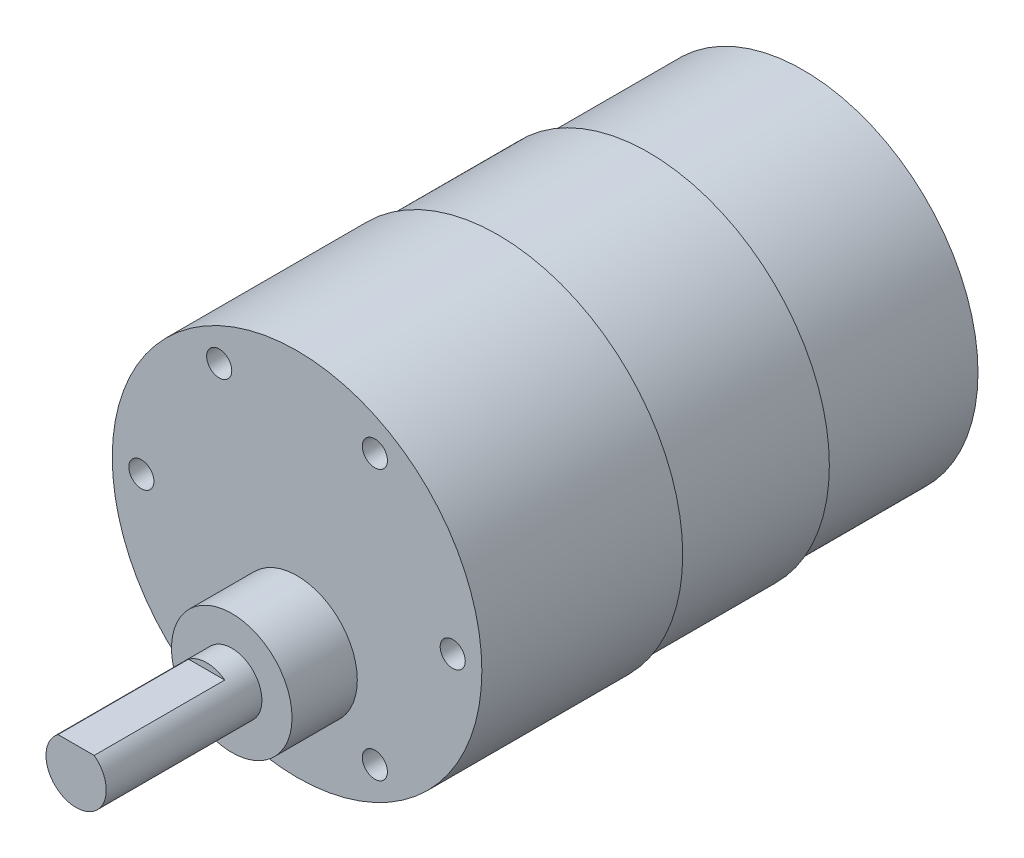
ISO-10303-21;
HEADER;
FILE_DESCRIPTION(('STEP AP214'),'2;1');
FILE_NAME('part.step','',(''),(''),'','','');
FILE_SCHEMA(('AUTOMOTIVE_DESIGN { 1 0 10303 214 1 1 1 1 }'));
ENDSEC;
DATA;
#1=APPLICATION_CONTEXT('core data for automotive mechanical design processes');
#2=APPLICATION_PROTOCOL_DEFINITION('international standard','automotive_design',2000,#1);
#3=PRODUCT_CONTEXT('',#1,'mechanical');
#4=PRODUCT('Part','Part','',(#3));
#5=PRODUCT_RELATED_PRODUCT_CATEGORY('part','',(#4));
#6=PRODUCT_DEFINITION_FORMATION('','',#4);
#7=PRODUCT_DEFINITION_CONTEXT('part definition',#1,'design');
#8=PRODUCT_DEFINITION('design','',#6,#7);
#9=PRODUCT_DEFINITION_SHAPE('','',#8);
#10=(LENGTH_UNIT() NAMED_UNIT(*) SI_UNIT(.MILLI.,.METRE.));
#11=(NAMED_UNIT(*) PLANE_ANGLE_UNIT() SI_UNIT($,.RADIAN.));
#12=(NAMED_UNIT(*) SI_UNIT($,.STERADIAN.) SOLID_ANGLE_UNIT());
#13=UNCERTAINTY_MEASURE_WITH_UNIT(LENGTH_MEASURE(1.E-05),#10,'distance_accuracy_value','');
#14=(GEOMETRIC_REPRESENTATION_CONTEXT(3) GLOBAL_UNCERTAINTY_ASSIGNED_CONTEXT((#13)) GLOBAL_UNIT_ASSIGNED_CONTEXT((#10,
#11,#12)) REPRESENTATION_CONTEXT('',''));
#15=CARTESIAN_POINT('',(0.,0.,0.));
#16=DIRECTION('',(0.,0.,1.));
#17=DIRECTION('',(1.,0.,0.));
#18=AXIS2_PLACEMENT_3D('',#15,#16,#17);
#19=CARTESIAN_POINT('',(0.,0.,15.4));
#20=DIRECTION('',(0.,0.,-1.));
#21=DIRECTION('',(-1.,0.,0.));
#22=AXIS2_PLACEMENT_3D('',#19,#20,#21);
#23=CYLINDRICAL_SURFACE('',#22,17.4);
#24=CARTESIAN_POINT('',(0.,0.,15.4));
#25=DIRECTION('',(0.,0.,1.));
#26=DIRECTION('',(1.,0.,0.));
#27=AXIS2_PLACEMENT_3D('',#24,#25,#26);
#28=CIRCLE('',#27,17.4);
#29=CARTESIAN_POINT('',(17.4,0.,15.4));
#30=VERTEX_POINT('',#29);
#31=EDGE_CURVE('E11',#30,#30,#28,.T.);
#32=ORIENTED_EDGE('',*,*,#31,.F.);
#33=EDGE_LOOP('',(#32));
#34=FACE_BOUND('',#33,.T.);
#35=CARTESIAN_POINT('',(0.,0.,0.));
#36=DIRECTION('',(0.,0.,1.));
#37=DIRECTION('',(1.,0.,0.));
#38=AXIS2_PLACEMENT_3D('',#35,#36,#37);
#39=CIRCLE('',#38,17.4);
#40=CARTESIAN_POINT('',(17.4,0.,0.));
#41=VERTEX_POINT('',#40);
#42=EDGE_CURVE('E43',#41,#41,#39,.T.);
#43=ORIENTED_EDGE('',*,*,#42,.T.);
#44=EDGE_LOOP('',(#43));
#45=FACE_BOUND('',#44,.T.);
#46=ADVANCED_FACE('F40',(#34,#45),#23,.T.);
#47=CARTESIAN_POINT('',(0.,0.,0.));
#48=DIRECTION('',(0.,0.,1.));
#49=DIRECTION('',(1.,0.,0.));
#50=AXIS2_PLACEMENT_3D('',#47,#48,#49);
#51=PLANE('',#50);
#52=ORIENTED_EDGE('',*,*,#42,.F.);
#53=EDGE_LOOP('',(#52));
#54=FACE_BOUND('',#53,.T.);
#55=ADVANCED_FACE('F133',(#54),#51,.F.);
#56=CARTESIAN_POINT('',(0.,0.,30.4));
#57=DIRECTION('',(0.,0.,-1.));
#58=DIRECTION('',(-1.,0.,0.));
#59=AXIS2_PLACEMENT_3D('',#56,#57,#58);
#60=CYLINDRICAL_SURFACE('',#59,18.);
#61=CARTESIAN_POINT('',(0.,0.,30.4));
#62=DIRECTION('',(0.,0.,1.));
#63=DIRECTION('',(1.,0.,0.));
#64=AXIS2_PLACEMENT_3D('',#61,#62,#63);
#65=CIRCLE('',#64,18.);
#66=CARTESIAN_POINT('',(18.,0.,30.4));
#67=VERTEX_POINT('',#66);
#68=EDGE_CURVE('E110',#67,#67,#65,.T.);
#69=ORIENTED_EDGE('',*,*,#68,.F.);
#70=EDGE_LOOP('',(#69));
#71=FACE_BOUND('',#70,.T.);
#72=CARTESIAN_POINT('',(0.,0.,15.4));
#73=DIRECTION('',(0.,0.,1.));
#74=DIRECTION('',(1.,0.,0.));
#75=AXIS2_PLACEMENT_3D('',#72,#73,#74);
#76=CIRCLE('',#75,18.);
#77=CARTESIAN_POINT('',(18.,0.,15.4));
#78=VERTEX_POINT('',#77);
#79=EDGE_CURVE('E106',#78,#78,#76,.T.);
#80=ORIENTED_EDGE('',*,*,#79,.T.);
#81=EDGE_LOOP('',(#80));
#82=FACE_BOUND('',#81,.T.);
#83=ADVANCED_FACE('F119',(#71,#82),#60,.T.);
#84=CARTESIAN_POINT('',(0.,0.,15.4));
#85=DIRECTION('',(0.,0.,1.));
#86=DIRECTION('',(1.,0.,0.));
#87=AXIS2_PLACEMENT_3D('',#84,#85,#86);
#88=PLANE('',#87);
#89=ORIENTED_EDGE('',*,*,#31,.T.);
#90=EDGE_LOOP('',(#89));
#91=FACE_BOUND('',#90,.T.);
#92=ORIENTED_EDGE('',*,*,#79,.F.);
#93=EDGE_LOOP('',(#92));
#94=FACE_BOUND('',#93,.T.);
#95=ADVANCED_FACE('F121',(#91,#94),#88,.F.);
#96=CARTESIAN_POINT('',(0.,0.,50.4));
#97=DIRECTION('',(0.,0.,-1.));
#98=DIRECTION('',(-1.,0.,0.));
#99=AXIS2_PLACEMENT_3D('',#96,#97,#98);
#100=CYLINDRICAL_SURFACE('',#99,18.4);
#101=CARTESIAN_POINT('',(0.,0.,50.4));
#102=DIRECTION('',(0.,0.,1.));
#103=DIRECTION('',(1.,0.,0.));
#104=AXIS2_PLACEMENT_3D('',#101,#102,#103);
#105=CIRCLE('',#104,18.4);
#106=CARTESIAN_POINT('',(18.4,0.,50.4));
#107=VERTEX_POINT('',#106);
#108=EDGE_CURVE('E102',#107,#107,#105,.T.);
#109=ORIENTED_EDGE('',*,*,#108,.F.);
#110=EDGE_LOOP('',(#109));
#111=FACE_BOUND('',#110,.T.);
#112=CARTESIAN_POINT('',(0.,0.,30.4));
#113=DIRECTION('',(0.,0.,1.));
#114=DIRECTION('',(1.,0.,0.));
#115=AXIS2_PLACEMENT_3D('',#112,#113,#114);
#116=CIRCLE('',#115,18.4);
#117=CARTESIAN_POINT('',(18.4,0.,30.4));
#118=VERTEX_POINT('',#117);
#119=EDGE_CURVE('E100',#118,#118,#116,.T.);
#120=ORIENTED_EDGE('',*,*,#119,.T.);
#121=EDGE_LOOP('',(#120));
#122=FACE_BOUND('',#121,.T.);
#123=ADVANCED_FACE('F123',(#111,#122),#100,.T.);
#124=CARTESIAN_POINT('',(0.,0.,50.4));
#125=DIRECTION('',(0.,0.,1.));
#126=DIRECTION('',(1.,0.,0.));
#127=AXIS2_PLACEMENT_3D('',#124,#125,#126);
#128=PLANE('',#127);
#129=CARTESIAN_POINT('',(-15.5,0.,50.4));
#130=DIRECTION('',(0.,0.,1.));
#131=DIRECTION('',(1.,0.,0.));
#132=AXIS2_PLACEMENT_3D('',#129,#130,#131);
#133=CIRCLE('',#132,1.25);
#134=CARTESIAN_POINT('',(-14.25,0.,50.4));
#135=VERTEX_POINT('',#134);
#136=EDGE_CURVE('E194',#135,#135,#133,.T.);
#137=ORIENTED_EDGE('',*,*,#136,.F.);
#138=EDGE_LOOP('',(#137));
#139=FACE_BOUND('',#138,.T.);
#140=CARTESIAN_POINT('',(-7.74999999999997,13.4233937586588,50.4));
#141=DIRECTION('',(0.,0.,1.));
#142=DIRECTION('',(1.,0.,0.));
#143=AXIS2_PLACEMENT_3D('',#140,#141,#142);
#144=CIRCLE('',#143,1.25);
#145=CARTESIAN_POINT('',(-6.49999999999997,13.4233937586588,50.4));
#146=VERTEX_POINT('',#145);
#147=EDGE_CURVE('E186',#146,#146,#144,.T.);
#148=ORIENTED_EDGE('',*,*,#147,.F.);
#149=EDGE_LOOP('',(#148));
#150=FACE_BOUND('',#149,.T.);
#151=CARTESIAN_POINT('',(7.75000000000006,13.4233937586588,50.4));
#152=DIRECTION('',(0.,0.,1.));
#153=DIRECTION('',(1.,0.,0.));
#154=AXIS2_PLACEMENT_3D('',#151,#152,#153);
#155=CIRCLE('',#154,1.25);
#156=CARTESIAN_POINT('',(9.00000000000006,13.4233937586588,50.4));
#157=VERTEX_POINT('',#156);
#158=EDGE_CURVE('E147',#157,#157,#155,.T.);
#159=ORIENTED_EDGE('',*,*,#158,.F.);
#160=EDGE_LOOP('',(#159));
#161=FACE_BOUND('',#160,.T.);
#162=CARTESIAN_POINT('',(15.5,-1.08235921504137E-13,50.4));
#163=DIRECTION('',(0.,0.,1.));
#164=DIRECTION('',(1.,0.,0.));
#165=AXIS2_PLACEMENT_3D('',#162,#163,#164);
#166=CIRCLE('',#165,1.25);
#167=CARTESIAN_POINT('',(16.75,-1.08235921504137E-13,50.4));
#168=VERTEX_POINT('',#167);
#169=EDGE_CURVE('E155',#168,#168,#166,.T.);
#170=ORIENTED_EDGE('',*,*,#169,.F.);
#171=EDGE_LOOP('',(#170));
#172=FACE_BOUND('',#171,.T.);
#173=CARTESIAN_POINT('',(7.74999999999987,-13.4233937586589,50.4));
#174=DIRECTION('',(0.,0.,1.));
#175=DIRECTION('',(1.,0.,0.));
#176=AXIS2_PLACEMENT_3D('',#173,#174,#175);
#177=CIRCLE('',#176,1.25);
#178=CARTESIAN_POINT('',(8.99999999999987,-13.4233937586589,50.4));
#179=VERTEX_POINT('',#178);
#180=EDGE_CURVE('E174',#179,#179,#177,.T.);
#181=ORIENTED_EDGE('',*,*,#180,.F.);
#182=EDGE_LOOP('',(#181));
#183=FACE_BOUND('',#182,.T.);
#184=CARTESIAN_POINT('',(-7.75000000000016,-13.4233937586587,50.4));
#185=DIRECTION('',(0.,0.,1.));
#186=DIRECTION('',(1.,0.,0.));
#187=AXIS2_PLACEMENT_3D('',#184,#185,#186);
#188=CIRCLE('',#187,1.25);
#189=CARTESIAN_POINT('',(-6.50000000000016,-13.4233937586587,50.4));
#190=VERTEX_POINT('',#189);
#191=EDGE_CURVE('E167',#190,#190,#188,.T.);
#192=ORIENTED_EDGE('',*,*,#191,.F.);
#193=EDGE_LOOP('',(#192));
#194=FACE_BOUND('',#193,.T.);
#195=CARTESIAN_POINT('',(0.,-7.,50.4));
#196=DIRECTION('',(0.,0.,1.));
#197=DIRECTION('',(1.,0.,0.));
#198=AXIS2_PLACEMENT_3D('',#195,#196,#197);
#199=CIRCLE('',#198,6.);
#200=CARTESIAN_POINT('',(6.,-7.,50.4));
#201=VERTEX_POINT('',#200);
#202=EDGE_CURVE('E87',#201,#201,#199,.T.);
#203=ORIENTED_EDGE('',*,*,#202,.F.);
#204=EDGE_LOOP('',(#203));
#205=FACE_BOUND('',#204,.T.);
#206=ORIENTED_EDGE('',*,*,#108,.T.);
#207=EDGE_LOOP('',(#206));
#208=FACE_BOUND('',#207,.T.);
#209=ADVANCED_FACE('F130',(#139,#150,#161,#172,#183,#194,#205,#208),#128,.T.);
#210=CARTESIAN_POINT('',(0.,0.,30.4));
#211=DIRECTION('',(0.,0.,1.));
#212=DIRECTION('',(1.,0.,0.));
#213=AXIS2_PLACEMENT_3D('',#210,#211,#212);
#214=PLANE('',#213);
#215=ORIENTED_EDGE('',*,*,#68,.T.);
#216=EDGE_LOOP('',(#215));
#217=FACE_BOUND('',#216,.T.);
#218=ORIENTED_EDGE('',*,*,#119,.F.);
#219=EDGE_LOOP('',(#218));
#220=FACE_BOUND('',#219,.T.);
#221=ADVANCED_FACE('F203',(#217,#220),#214,.F.);
#222=CARTESIAN_POINT('',(0.,-7.,56.9));
#223=DIRECTION('',(0.,0.,-1.));
#224=DIRECTION('',(-1.,0.,0.));
#225=AXIS2_PLACEMENT_3D('',#222,#223,#224);
#226=CYLINDRICAL_SURFACE('',#225,6.);
#227=CARTESIAN_POINT('',(0.,-7.,56.9));
#228=DIRECTION('',(0.,0.,1.));
#229=DIRECTION('',(1.,0.,0.));
#230=AXIS2_PLACEMENT_3D('',#227,#228,#229);
#231=CIRCLE('',#230,6.);
#232=CARTESIAN_POINT('',(6.,-7.,56.9));
#233=VERTEX_POINT('',#232);
#234=EDGE_CURVE('E91',#233,#233,#231,.T.);
#235=ORIENTED_EDGE('',*,*,#234,.F.);
#236=EDGE_LOOP('',(#235));
#237=FACE_BOUND('',#236,.T.);
#238=ORIENTED_EDGE('',*,*,#202,.T.);
#239=EDGE_LOOP('',(#238));
#240=FACE_BOUND('',#239,.T.);
#241=ADVANCED_FACE('F222',(#237,#240),#226,.T.);
#242=CARTESIAN_POINT('',(0.,-7.,56.9));
#243=DIRECTION('',(0.,0.,1.));
#244=DIRECTION('',(1.,0.,0.));
#245=AXIS2_PLACEMENT_3D('',#242,#243,#244);
#246=PLANE('',#245);
#247=CARTESIAN_POINT('',(0.,-7.,56.9));
#248=DIRECTION('',(0.,0.,1.));
#249=DIRECTION('',(1.,0.,0.));
#250=AXIS2_PLACEMENT_3D('',#247,#248,#249);
#251=CIRCLE('',#250,3.);
#252=CARTESIAN_POINT('',(3.,-7.,56.9));
#253=VERTEX_POINT('',#252);
#254=EDGE_CURVE('E83',#253,#253,#251,.T.);
#255=ORIENTED_EDGE('',*,*,#254,.F.);
#256=EDGE_LOOP('',(#255));
#257=FACE_BOUND('',#256,.T.);
#258=ORIENTED_EDGE('',*,*,#234,.T.);
#259=EDGE_LOOP('',(#258));
#260=FACE_BOUND('',#259,.T.);
#261=ADVANCED_FACE('F228',(#257,#260),#246,.T.);
#262=CARTESIAN_POINT('',(0.,-7.,72.4));
#263=DIRECTION('',(0.,0.,-1.));
#264=DIRECTION('',(-1.,0.,0.));
#265=AXIS2_PLACEMENT_3D('',#262,#263,#264);
#266=CYLINDRICAL_SURFACE('',#265,3.);
#267=CARTESIAN_POINT('',(0.,-7.,72.4));
#268=DIRECTION('',(0.,0.,1.));
#269=DIRECTION('',(1.,0.,0.));
#270=AXIS2_PLACEMENT_3D('',#267,#268,#269);
#271=CIRCLE('',#270,3.);
#272=CARTESIAN_POINT('',(-1.8,-4.6,72.4));
#273=VERTEX_POINT('',#272);
#274=CARTESIAN_POINT('',(1.8,-4.6,72.4));
#275=VERTEX_POINT('',#274);
#276=EDGE_CURVE('E82',#273,#275,#271,.T.);
#277=ORIENTED_EDGE('',*,*,#276,.F.);
#278=DIRECTION('',(0.,0.,1.));
#279=VECTOR('',#278,1.);
#280=CARTESIAN_POINT('',(-1.8,-4.6,59.4));
#281=LINE('',#280,#279);
#282=CARTESIAN_POINT('',(-1.8,-4.6,59.4));
#283=VERTEX_POINT('',#282);
#284=EDGE_CURVE('E57',#283,#273,#281,.T.);
#285=ORIENTED_EDGE('',*,*,#284,.F.);
#286=CARTESIAN_POINT('',(0.,-7.00000000000001,59.4));
#287=DIRECTION('',(0.,0.,1.));
#288=DIRECTION('',(-1.,0.,0.));
#289=AXIS2_PLACEMENT_3D('',#286,#287,#288);
#290=CIRCLE('',#289,3.00000000000001);
#291=CARTESIAN_POINT('',(1.8,-4.6,59.4));
#292=VERTEX_POINT('',#291);
#293=EDGE_CURVE('E75',#292,#283,#290,.T.);
#294=ORIENTED_EDGE('',*,*,#293,.F.);
#295=DIRECTION('',(0.,0.,1.));
#296=VECTOR('',#295,1.);
#297=CARTESIAN_POINT('',(1.8,-4.6,59.4));
#298=LINE('',#297,#296);
#299=EDGE_CURVE('E64',#292,#275,#298,.T.);
#300=ORIENTED_EDGE('',*,*,#299,.T.);
#301=EDGE_LOOP('',(#277,#285,#294,#300));
#302=FACE_BOUND('',#301,.T.);
#303=ORIENTED_EDGE('',*,*,#254,.T.);
#304=EDGE_LOOP('',(#303));
#305=FACE_BOUND('',#304,.T.);
#306=ADVANCED_FACE('F80',(#302,#305),#266,.T.);
#307=CARTESIAN_POINT('',(0.,-7.,72.4));
#308=DIRECTION('',(0.,0.,1.));
#309=DIRECTION('',(1.,0.,0.));
#310=AXIS2_PLACEMENT_3D('',#307,#308,#309);
#311=PLANE('',#310);
#312=DIRECTION('',(1.,0.,0.));
#313=VECTOR('',#312,1.);
#314=CARTESIAN_POINT('',(-1.8,-4.6,72.4));
#315=LINE('',#314,#313);
#316=EDGE_CURVE('E69',#273,#275,#315,.T.);
#317=ORIENTED_EDGE('',*,*,#316,.F.);
#318=ORIENTED_EDGE('',*,*,#276,.T.);
#319=EDGE_LOOP('',(#317,#318));
#320=FACE_BOUND('',#319,.T.);
#321=ADVANCED_FACE('F85',(#320),#311,.T.);
#322=CARTESIAN_POINT('',(-1.8,-4.6,59.4));
#323=DIRECTION('',(0.,-1.,0.));
#324=DIRECTION('',(0.,0.,-1.));
#325=AXIS2_PLACEMENT_3D('',#322,#323,#324);
#326=PLANE('',#325);
#327=ORIENTED_EDGE('',*,*,#316,.T.);
#328=ORIENTED_EDGE('',*,*,#299,.F.);
#329=DIRECTION('',(1.,0.,0.));
#330=VECTOR('',#329,1.);
#331=CARTESIAN_POINT('',(-1.8,-4.6,59.4));
#332=LINE('',#331,#330);
#333=EDGE_CURVE('E157',#283,#292,#332,.T.);
#334=ORIENTED_EDGE('',*,*,#333,.F.);
#335=ORIENTED_EDGE('',*,*,#284,.T.);
#336=EDGE_LOOP('',(#327,#328,#334,#335));
#337=FACE_BOUND('',#336,.T.);
#338=ADVANCED_FACE('F70',(#337),#326,.F.);
#339=CARTESIAN_POINT('',(0.,-7.00000000000001,59.4));
#340=DIRECTION('',(0.,0.,-1.));
#341=DIRECTION('',(-1.,0.,0.));
#342=AXIS2_PLACEMENT_3D('',#339,#340,#341);
#343=PLANE('',#342);
#344=ORIENTED_EDGE('',*,*,#293,.T.);
#345=ORIENTED_EDGE('',*,*,#333,.T.);
#346=EDGE_LOOP('',(#344,#345));
#347=FACE_BOUND('',#346,.T.);
#348=ADVANCED_FACE('F241',(#347),#343,.F.);
#349=CARTESIAN_POINT('',(-7.75000000000016,-13.4233937586587,39.64));
#350=DIRECTION('',(0.,0.,-1.));
#351=DIRECTION('',(-1.,0.,0.));
#352=AXIS2_PLACEMENT_3D('',#349,#350,#351);
#353=PLANE('',#352);
#354=CARTESIAN_POINT('',(-7.75000000000016,-13.4233937586587,39.64));
#355=DIRECTION('',(0.,0.,1.));
#356=DIRECTION('',(1.,0.,0.));
#357=AXIS2_PLACEMENT_3D('',#354,#355,#356);
#358=CIRCLE('',#357,1.25);
#359=CARTESIAN_POINT('',(-6.50000000000016,-13.4233937586587,39.64));
#360=VERTEX_POINT('',#359);
#361=EDGE_CURVE('E76',#360,#360,#358,.T.);
#362=ORIENTED_EDGE('',*,*,#361,.T.);
#363=EDGE_LOOP('',(#362));
#364=FACE_BOUND('',#363,.T.);
#365=ADVANCED_FACE('F244',(#364),#353,.F.);
#366=CARTESIAN_POINT('',(-7.75000000000016,-13.4233937586587,50.4));
#367=DIRECTION('',(0.,0.,1.));
#368=DIRECTION('',(1.,0.,0.));
#369=AXIS2_PLACEMENT_3D('',#366,#367,#368);
#370=CYLINDRICAL_SURFACE('',#369,1.25);
#371=ORIENTED_EDGE('',*,*,#361,.F.);
#372=EDGE_LOOP('',(#371));
#373=FACE_BOUND('',#372,.T.);
#374=ORIENTED_EDGE('',*,*,#191,.T.);
#375=EDGE_LOOP('',(#374));
#376=FACE_BOUND('',#375,.T.);
#377=ADVANCED_FACE('F247',(#373,#376),#370,.F.);
#378=CARTESIAN_POINT('',(7.74999999999987,-13.4233937586589,39.64));
#379=DIRECTION('',(0.,0.,-1.));
#380=DIRECTION('',(-1.,0.,0.));
#381=AXIS2_PLACEMENT_3D('',#378,#379,#380);
#382=PLANE('',#381);
#383=CARTESIAN_POINT('',(7.74999999999987,-13.4233937586589,39.64));
#384=DIRECTION('',(0.,0.,1.));
#385=DIRECTION('',(1.,0.,0.));
#386=AXIS2_PLACEMENT_3D('',#383,#384,#385);
#387=CIRCLE('',#386,1.25);
#388=CARTESIAN_POINT('',(8.99999999999987,-13.4233937586589,39.64));
#389=VERTEX_POINT('',#388);
#390=EDGE_CURVE('E171',#389,#389,#387,.T.);
#391=ORIENTED_EDGE('',*,*,#390,.T.);
#392=EDGE_LOOP('',(#391));
#393=FACE_BOUND('',#392,.T.);
#394=ADVANCED_FACE('F251',(#393),#382,.F.);
#395=CARTESIAN_POINT('',(7.74999999999987,-13.4233937586589,50.4));
#396=DIRECTION('',(0.,0.,1.));
#397=DIRECTION('',(1.,0.,0.));
#398=AXIS2_PLACEMENT_3D('',#395,#396,#397);
#399=CYLINDRICAL_SURFACE('',#398,1.25);
#400=ORIENTED_EDGE('',*,*,#390,.F.);
#401=EDGE_LOOP('',(#400));
#402=FACE_BOUND('',#401,.T.);
#403=ORIENTED_EDGE('',*,*,#180,.T.);
#404=EDGE_LOOP('',(#403));
#405=FACE_BOUND('',#404,.T.);
#406=ADVANCED_FACE('F255',(#402,#405),#399,.F.);
#407=CARTESIAN_POINT('',(15.5,-1.08235921504137E-13,39.64));
#408=DIRECTION('',(0.,0.,-1.));
#409=DIRECTION('',(-1.,0.,0.));
#410=AXIS2_PLACEMENT_3D('',#407,#408,#409);
#411=PLANE('',#410);
#412=CARTESIAN_POINT('',(15.5,-1.08235921504137E-13,39.64));
#413=DIRECTION('',(0.,0.,1.));
#414=DIRECTION('',(1.,0.,0.));
#415=AXIS2_PLACEMENT_3D('',#412,#413,#414);
#416=CIRCLE('',#415,1.25);
#417=CARTESIAN_POINT('',(16.75,-1.08235921504137E-13,39.64));
#418=VERTEX_POINT('',#417);
#419=EDGE_CURVE('E178',#418,#418,#416,.T.);
#420=ORIENTED_EDGE('',*,*,#419,.T.);
#421=EDGE_LOOP('',(#420));
#422=FACE_BOUND('',#421,.T.);
#423=ADVANCED_FACE('F259',(#422),#411,.F.);
#424=CARTESIAN_POINT('',(15.5,-1.08235921504137E-13,50.4));
#425=DIRECTION('',(0.,0.,1.));
#426=DIRECTION('',(1.,0.,0.));
#427=AXIS2_PLACEMENT_3D('',#424,#425,#426);
#428=CYLINDRICAL_SURFACE('',#427,1.25);
#429=ORIENTED_EDGE('',*,*,#419,.F.);
#430=EDGE_LOOP('',(#429));
#431=FACE_BOUND('',#430,.T.);
#432=ORIENTED_EDGE('',*,*,#169,.T.);
#433=EDGE_LOOP('',(#432));
#434=FACE_BOUND('',#433,.T.);
#435=ADVANCED_FACE('F263',(#431,#434),#428,.F.);
#436=CARTESIAN_POINT('',(7.75000000000006,13.4233937586588,39.64));
#437=DIRECTION('',(0.,0.,-1.));
#438=DIRECTION('',(-1.,0.,0.));
#439=AXIS2_PLACEMENT_3D('',#436,#437,#438);
#440=PLANE('',#439);
#441=CARTESIAN_POINT('',(7.75000000000006,13.4233937586588,39.64));
#442=DIRECTION('',(0.,0.,1.));
#443=DIRECTION('',(1.,0.,0.));
#444=AXIS2_PLACEMENT_3D('',#441,#442,#443);
#445=CIRCLE('',#444,1.25);
#446=CARTESIAN_POINT('',(9.00000000000006,13.4233937586588,39.64));
#447=VERTEX_POINT('',#446);
#448=EDGE_CURVE('E150',#447,#447,#445,.T.);
#449=ORIENTED_EDGE('',*,*,#448,.T.);
#450=EDGE_LOOP('',(#449));
#451=FACE_BOUND('',#450,.T.);
#452=ADVANCED_FACE('F267',(#451),#440,.F.);
#453=CARTESIAN_POINT('',(7.75000000000006,13.4233937586588,50.4));
#454=DIRECTION('',(0.,0.,1.));
#455=DIRECTION('',(1.,0.,0.));
#456=AXIS2_PLACEMENT_3D('',#453,#454,#455);
#457=CYLINDRICAL_SURFACE('',#456,1.25);
#458=ORIENTED_EDGE('',*,*,#448,.F.);
#459=EDGE_LOOP('',(#458));
#460=FACE_BOUND('',#459,.T.);
#461=ORIENTED_EDGE('',*,*,#158,.T.);
#462=EDGE_LOOP('',(#461));
#463=FACE_BOUND('',#462,.T.);
#464=ADVANCED_FACE('F271',(#460,#463),#457,.F.);
#465=CARTESIAN_POINT('',(-7.74999999999997,13.4233937586588,39.64));
#466=DIRECTION('',(0.,0.,-1.));
#467=DIRECTION('',(-1.,0.,0.));
#468=AXIS2_PLACEMENT_3D('',#465,#466,#467);
#469=PLANE('',#468);
#470=CARTESIAN_POINT('',(-7.74999999999997,13.4233937586588,39.64));
#471=DIRECTION('',(0.,0.,1.));
#472=DIRECTION('',(1.,0.,0.));
#473=AXIS2_PLACEMENT_3D('',#470,#471,#472);
#474=CIRCLE('',#473,1.25);
#475=CARTESIAN_POINT('',(-6.49999999999997,13.4233937586588,39.64));
#476=VERTEX_POINT('',#475);
#477=EDGE_CURVE('E151',#476,#476,#474,.T.);
#478=ORIENTED_EDGE('',*,*,#477,.T.);
#479=EDGE_LOOP('',(#478));
#480=FACE_BOUND('',#479,.T.);
#481=ADVANCED_FACE('F275',(#480),#469,.F.);
#482=CARTESIAN_POINT('',(-7.74999999999997,13.4233937586588,50.4));
#483=DIRECTION('',(0.,0.,1.));
#484=DIRECTION('',(1.,0.,0.));
#485=AXIS2_PLACEMENT_3D('',#482,#483,#484);
#486=CYLINDRICAL_SURFACE('',#485,1.25);
#487=ORIENTED_EDGE('',*,*,#477,.F.);
#488=EDGE_LOOP('',(#487));
#489=FACE_BOUND('',#488,.T.);
#490=ORIENTED_EDGE('',*,*,#147,.T.);
#491=EDGE_LOOP('',(#490));
#492=FACE_BOUND('',#491,.T.);
#493=ADVANCED_FACE('F279',(#489,#492),#486,.F.);
#494=CARTESIAN_POINT('',(-15.5,0.,39.64));
#495=DIRECTION('',(0.,0.,-1.));
#496=DIRECTION('',(-1.,0.,0.));
#497=AXIS2_PLACEMENT_3D('',#494,#495,#496);
#498=PLANE('',#497);
#499=CARTESIAN_POINT('',(-15.5,0.,39.64));
#500=DIRECTION('',(0.,0.,1.));
#501=DIRECTION('',(1.,0.,0.));
#502=AXIS2_PLACEMENT_3D('',#499,#500,#501);
#503=CIRCLE('',#502,1.25);
#504=CARTESIAN_POINT('',(-14.25,0.,39.64));
#505=VERTEX_POINT('',#504);
#506=EDGE_CURVE('E190',#505,#505,#503,.T.);
#507=ORIENTED_EDGE('',*,*,#506,.T.);
#508=EDGE_LOOP('',(#507));
#509=FACE_BOUND('',#508,.T.);
#510=ADVANCED_FACE('F283',(#509),#498,.F.);
#511=CARTESIAN_POINT('',(-15.5,0.,50.4));
#512=DIRECTION('',(0.,0.,1.));
#513=DIRECTION('',(1.,0.,0.));
#514=AXIS2_PLACEMENT_3D('',#511,#512,#513);
#515=CYLINDRICAL_SURFACE('',#514,1.25);
#516=ORIENTED_EDGE('',*,*,#506,.F.);
#517=EDGE_LOOP('',(#516));
#518=FACE_BOUND('',#517,.T.);
#519=ORIENTED_EDGE('',*,*,#136,.T.);
#520=EDGE_LOOP('',(#519));
#521=FACE_BOUND('',#520,.T.);
#522=ADVANCED_FACE('F199',(#518,#521),#515,.F.);
#523=CLOSED_SHELL('',(#46,#55,#83,#95,#123,#209,#221,#241,#261,#306,#321,#338,#348,#365,#377,
#394,#406,#423,#435,#452,#464,#481,#493,#510,#522));
#524=MANIFOLD_SOLID_BREP('B2',#523);
#525=ADVANCED_BREP_SHAPE_REPRESENTATION('',(#18,#524),#14);
#526=SHAPE_DEFINITION_REPRESENTATION(#9,#525);
ENDSEC;
END-ISO-10303-21;
